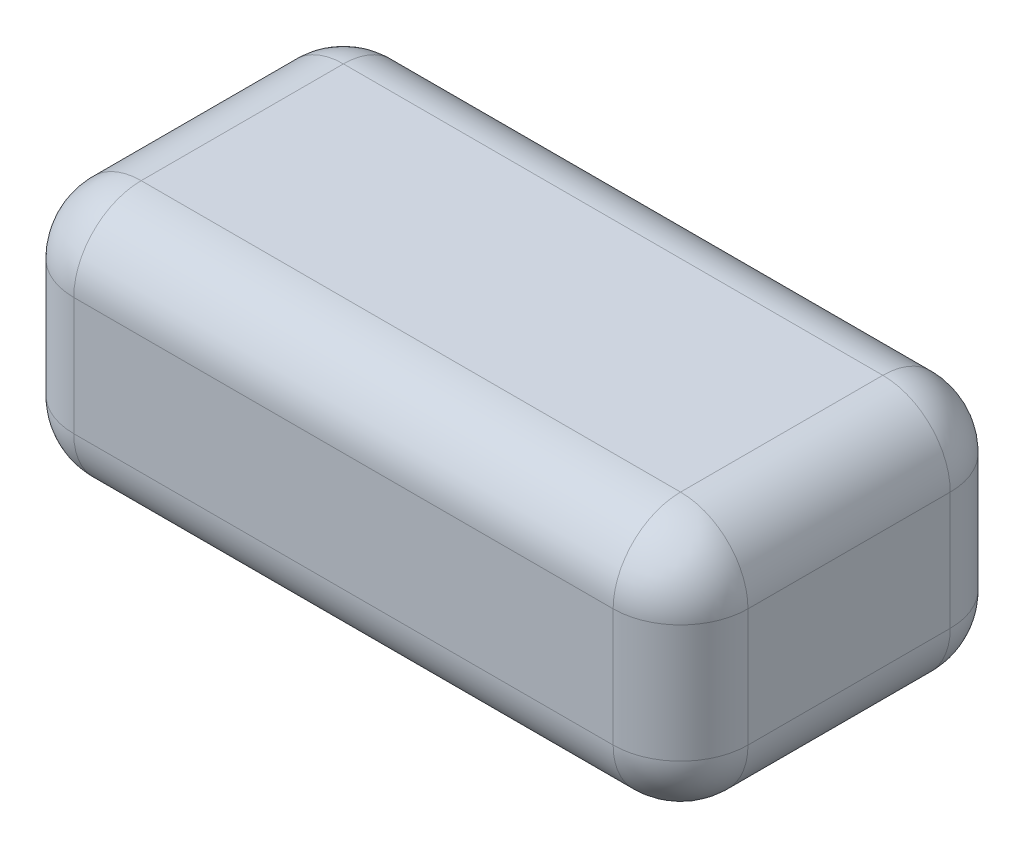
ISO-10303-21;
HEADER;
FILE_DESCRIPTION(('STEP AP214'),'2;1');
FILE_NAME('part.step','',(''),(''),'','','');
FILE_SCHEMA(('AUTOMOTIVE_DESIGN { 1 0 10303 214 1 1 1 1 }'));
ENDSEC;
DATA;
#1=APPLICATION_CONTEXT('core data for automotive mechanical design processes');
#2=APPLICATION_PROTOCOL_DEFINITION('international standard','automotive_design',2000,#1);
#3=PRODUCT_CONTEXT('',#1,'mechanical');
#4=PRODUCT('Part','Part','',(#3));
#5=PRODUCT_RELATED_PRODUCT_CATEGORY('part','',(#4));
#6=PRODUCT_DEFINITION_FORMATION('','',#4);
#7=PRODUCT_DEFINITION_CONTEXT('part definition',#1,'design');
#8=PRODUCT_DEFINITION('design','',#6,#7);
#9=PRODUCT_DEFINITION_SHAPE('','',#8);
#10=(LENGTH_UNIT() NAMED_UNIT(*) SI_UNIT(.MILLI.,.METRE.));
#11=(NAMED_UNIT(*) PLANE_ANGLE_UNIT() SI_UNIT($,.RADIAN.));
#12=(NAMED_UNIT(*) SI_UNIT($,.STERADIAN.) SOLID_ANGLE_UNIT());
#13=UNCERTAINTY_MEASURE_WITH_UNIT(LENGTH_MEASURE(1.E-05),#10,'distance_accuracy_value','');
#14=(GEOMETRIC_REPRESENTATION_CONTEXT(3) GLOBAL_UNCERTAINTY_ASSIGNED_CONTEXT((#13)) GLOBAL_UNIT_ASSIGNED_CONTEXT((#10,
#11,#12)) REPRESENTATION_CONTEXT('',''));
#15=CARTESIAN_POINT('',(0.,0.,0.));
#16=DIRECTION('',(0.,0.,1.));
#17=DIRECTION('',(1.,0.,0.));
#18=AXIS2_PLACEMENT_3D('',#15,#16,#17);
#19=CARTESIAN_POINT('',(100.,75.,50.));
#20=DIRECTION('',(-1.,0.,0.));
#21=DIRECTION('',(0.,0.,1.));
#22=AXIS2_PLACEMENT_3D('',#19,#20,#21);
#23=PLANE('',#22);
#24=DIRECTION('',(0.,0.,-1.));
#25=VECTOR('',#24,1.);
#26=CARTESIAN_POINT('',(100.,20.,-50.));
#27=LINE('',#26,#25);
#28=CARTESIAN_POINT('',(100.,20.,30.));
#29=VERTEX_POINT('',#28);
#30=CARTESIAN_POINT('',(100.,20.,-30.));
#31=VERTEX_POINT('',#30);
#32=EDGE_CURVE('E223',#29,#31,#27,.T.);
#33=ORIENTED_EDGE('',*,*,#32,.T.);
#34=DIRECTION('',(0.,-1.,0.));
#35=VECTOR('',#34,1.);
#36=CARTESIAN_POINT('',(100.,75.,-30.));
#37=LINE('',#36,#35);
#38=CARTESIAN_POINT('',(100.,55.,-30.));
#39=VERTEX_POINT('',#38);
#40=EDGE_CURVE('E226',#31,#39,#37,.F.);
#41=ORIENTED_EDGE('',*,*,#40,.T.);
#42=DIRECTION('',(0.,0.,-1.));
#43=VECTOR('',#42,1.);
#44=CARTESIAN_POINT('',(100.,55.,50.));
#45=LINE('',#44,#43);
#46=CARTESIAN_POINT('',(100.,55.,30.));
#47=VERTEX_POINT('',#46);
#48=EDGE_CURVE('E220',#39,#47,#45,.F.);
#49=ORIENTED_EDGE('',*,*,#48,.T.);
#50=DIRECTION('',(0.,-1.,0.));
#51=VECTOR('',#50,1.);
#52=CARTESIAN_POINT('',(100.,75.,30.));
#53=LINE('',#52,#51);
#54=EDGE_CURVE('E217',#47,#29,#53,.T.);
#55=ORIENTED_EDGE('',*,*,#54,.T.);
#56=EDGE_LOOP('',(#33,#41,#49,#55));
#57=FACE_BOUND('',#56,.T.);
#58=ADVANCED_FACE('F43',(#57),#23,.F.);
#59=CARTESIAN_POINT('',(-100.,75.,-50.));
#60=DIRECTION('',(0.,0.,1.));
#61=DIRECTION('',(1.,0.,0.));
#62=AXIS2_PLACEMENT_3D('',#59,#60,#61);
#63=PLANE('',#62);
#64=DIRECTION('',(-1.,0.,0.));
#65=VECTOR('',#64,1.);
#66=CARTESIAN_POINT('',(-100.,20.,-50.));
#67=LINE('',#66,#65);
#68=CARTESIAN_POINT('',(80.,20.,-50.));
#69=VERTEX_POINT('',#68);
#70=CARTESIAN_POINT('',(-80.,20.,-50.));
#71=VERTEX_POINT('',#70);
#72=EDGE_CURVE('E197',#69,#71,#67,.T.);
#73=ORIENTED_EDGE('',*,*,#72,.T.);
#74=DIRECTION('',(0.,-1.,0.));
#75=VECTOR('',#74,1.);
#76=CARTESIAN_POINT('',(-80.,75.,-50.));
#77=LINE('',#76,#75);
#78=CARTESIAN_POINT('',(-80.,55.,-50.));
#79=VERTEX_POINT('',#78);
#80=EDGE_CURVE('E200',#71,#79,#77,.F.);
#81=ORIENTED_EDGE('',*,*,#80,.T.);
#82=DIRECTION('',(-1.,0.,0.));
#83=VECTOR('',#82,1.);
#84=CARTESIAN_POINT('',(-100.,55.,-50.));
#85=LINE('',#84,#83);
#86=CARTESIAN_POINT('',(80.,55.,-50.));
#87=VERTEX_POINT('',#86);
#88=EDGE_CURVE('E194',#79,#87,#85,.F.);
#89=ORIENTED_EDGE('',*,*,#88,.T.);
#90=DIRECTION('',(0.,-1.,0.));
#91=VECTOR('',#90,1.);
#92=CARTESIAN_POINT('',(80.,75.,-50.));
#93=LINE('',#92,#91);
#94=EDGE_CURVE('E191',#87,#69,#93,.T.);
#95=ORIENTED_EDGE('',*,*,#94,.T.);
#96=EDGE_LOOP('',(#73,#81,#89,#95));
#97=FACE_BOUND('',#96,.T.);
#98=ADVANCED_FACE('F344',(#97),#63,.F.);
#99=CARTESIAN_POINT('',(-100.,75.,50.));
#100=DIRECTION('',(1.,0.,0.));
#101=DIRECTION('',(0.,0.,-1.));
#102=AXIS2_PLACEMENT_3D('',#99,#100,#101);
#103=PLANE('',#102);
#104=DIRECTION('',(0.,-1.,0.));
#105=VECTOR('',#104,1.);
#106=CARTESIAN_POINT('',(-100.,75.,-30.));
#107=LINE('',#106,#105);
#108=CARTESIAN_POINT('',(-100.,55.,-30.));
#109=VERTEX_POINT('',#108);
#110=CARTESIAN_POINT('',(-100.,20.,-30.));
#111=VERTEX_POINT('',#110);
#112=EDGE_CURVE('E172',#109,#111,#107,.T.);
#113=ORIENTED_EDGE('',*,*,#112,.T.);
#114=DIRECTION('',(0.,0.,1.));
#115=VECTOR('',#114,1.);
#116=CARTESIAN_POINT('',(-100.,20.,50.));
#117=LINE('',#116,#115);
#118=CARTESIAN_POINT('',(-100.,20.,30.));
#119=VERTEX_POINT('',#118);
#120=EDGE_CURVE('E141',#111,#119,#117,.T.);
#121=ORIENTED_EDGE('',*,*,#120,.T.);
#122=DIRECTION('',(0.,-1.,0.));
#123=VECTOR('',#122,1.);
#124=CARTESIAN_POINT('',(-100.,75.,30.));
#125=LINE('',#124,#123);
#126=CARTESIAN_POINT('',(-100.,55.,30.));
#127=VERTEX_POINT('',#126);
#128=EDGE_CURVE('E161',#119,#127,#125,.F.);
#129=ORIENTED_EDGE('',*,*,#128,.T.);
#130=DIRECTION('',(0.,0.,1.));
#131=VECTOR('',#130,1.);
#132=CARTESIAN_POINT('',(-100.,55.,50.));
#133=LINE('',#132,#131);
#134=EDGE_CURVE('E168',#127,#109,#133,.F.);
#135=ORIENTED_EDGE('',*,*,#134,.T.);
#136=EDGE_LOOP('',(#113,#121,#129,#135));
#137=FACE_BOUND('',#136,.T.);
#138=ADVANCED_FACE('F170',(#137),#103,.F.);
#139=CARTESIAN_POINT('',(-100.,75.,50.));
#140=DIRECTION('',(0.,0.,-1.));
#141=DIRECTION('',(-1.,0.,0.));
#142=AXIS2_PLACEMENT_3D('',#139,#140,#141);
#143=PLANE('',#142);
#144=DIRECTION('',(0.,-1.,0.));
#145=VECTOR('',#144,1.);
#146=CARTESIAN_POINT('',(-80.,75.,50.));
#147=LINE('',#146,#145);
#148=CARTESIAN_POINT('',(-80.,55.,50.));
#149=VERTEX_POINT('',#148);
#150=CARTESIAN_POINT('',(-80.,20.,50.));
#151=VERTEX_POINT('',#150);
#152=EDGE_CURVE('E230',#149,#151,#147,.T.);
#153=ORIENTED_EDGE('',*,*,#152,.T.);
#154=DIRECTION('',(1.,0.,0.));
#155=VECTOR('',#154,1.);
#156=CARTESIAN_POINT('',(100.,20.,50.));
#157=LINE('',#156,#155);
#158=CARTESIAN_POINT('',(80.,20.,50.));
#159=VERTEX_POINT('',#158);
#160=EDGE_CURVE('E11',#151,#159,#157,.T.);
#161=ORIENTED_EDGE('',*,*,#160,.T.);
#162=DIRECTION('',(0.,-1.,0.));
#163=VECTOR('',#162,1.);
#164=CARTESIAN_POINT('',(80.,75.,50.));
#165=LINE('',#164,#163);
#166=CARTESIAN_POINT('',(80.,55.,50.));
#167=VERTEX_POINT('',#166);
#168=EDGE_CURVE('E53',#159,#167,#165,.F.);
#169=ORIENTED_EDGE('',*,*,#168,.T.);
#170=DIRECTION('',(1.,0.,0.));
#171=VECTOR('',#170,1.);
#172=CARTESIAN_POINT('',(-100.,55.,50.));
#173=LINE('',#172,#171);
#174=EDGE_CURVE('E233',#167,#149,#173,.F.);
#175=ORIENTED_EDGE('',*,*,#174,.T.);
#176=EDGE_LOOP('',(#153,#161,#169,#175));
#177=FACE_BOUND('',#176,.T.);
#178=ADVANCED_FACE('F369',(#177),#143,.F.);
#179=CARTESIAN_POINT('',(0.,75.,0.));
#180=DIRECTION('',(0.,-1.,0.));
#181=DIRECTION('',(0.,0.,-1.));
#182=AXIS2_PLACEMENT_3D('',#179,#180,#181);
#183=PLANE('',#182);
#184=DIRECTION('',(0.,0.,-1.));
#185=VECTOR('',#184,1.);
#186=CARTESIAN_POINT('',(80.,75.,0.));
#187=LINE('',#186,#185);
#188=CARTESIAN_POINT('',(80.,75.,30.));
#189=VERTEX_POINT('',#188);
#190=CARTESIAN_POINT('',(80.,75.,-30.));
#191=VERTEX_POINT('',#190);
#192=EDGE_CURVE('E210',#189,#191,#187,.T.);
#193=ORIENTED_EDGE('',*,*,#192,.T.);
#194=DIRECTION('',(-1.,0.,0.));
#195=VECTOR('',#194,1.);
#196=CARTESIAN_POINT('',(0.,75.,-30.));
#197=LINE('',#196,#195);
#198=CARTESIAN_POINT('',(-80.,75.,-30.));
#199=VERTEX_POINT('',#198);
#200=EDGE_CURVE('E213',#191,#199,#197,.T.);
#201=ORIENTED_EDGE('',*,*,#200,.T.);
#202=DIRECTION('',(0.,0.,1.));
#203=VECTOR('',#202,1.);
#204=CARTESIAN_POINT('',(-80.,75.,0.));
#205=LINE('',#204,#203);
#206=CARTESIAN_POINT('',(-80.,75.,30.));
#207=VERTEX_POINT('',#206);
#208=EDGE_CURVE('E204',#199,#207,#205,.T.);
#209=ORIENTED_EDGE('',*,*,#208,.T.);
#210=DIRECTION('',(1.,0.,0.));
#211=VECTOR('',#210,1.);
#212=CARTESIAN_POINT('',(0.,75.,30.));
#213=LINE('',#212,#211);
#214=EDGE_CURVE('E207',#207,#189,#213,.T.);
#215=ORIENTED_EDGE('',*,*,#214,.T.);
#216=EDGE_LOOP('',(#193,#201,#209,#215));
#217=FACE_BOUND('',#216,.T.);
#218=ADVANCED_FACE('F358',(#217),#183,.F.);
#219=CARTESIAN_POINT('',(0.,0.,0.));
#220=DIRECTION('',(0.,-1.,0.));
#221=DIRECTION('',(0.,0.,-1.));
#222=AXIS2_PLACEMENT_3D('',#219,#220,#221);
#223=PLANE('',#222);
#224=DIRECTION('',(1.,0.,0.));
#225=VECTOR('',#224,1.);
#226=CARTESIAN_POINT('',(-100.,0.,30.));
#227=LINE('',#226,#225);
#228=CARTESIAN_POINT('',(80.,0.,30.));
#229=VERTEX_POINT('',#228);
#230=CARTESIAN_POINT('',(-80.,0.,30.));
#231=VERTEX_POINT('',#230);
#232=EDGE_CURVE('E175',#229,#231,#227,.F.);
#233=ORIENTED_EDGE('',*,*,#232,.T.);
#234=DIRECTION('',(0.,0.,1.));
#235=VECTOR('',#234,1.);
#236=CARTESIAN_POINT('',(-80.,0.,-50.));
#237=LINE('',#236,#235);
#238=CARTESIAN_POINT('',(-80.,0.,-30.));
#239=VERTEX_POINT('',#238);
#240=EDGE_CURVE('E143',#231,#239,#237,.F.);
#241=ORIENTED_EDGE('',*,*,#240,.T.);
#242=DIRECTION('',(-1.,0.,0.));
#243=VECTOR('',#242,1.);
#244=CARTESIAN_POINT('',(100.,0.,-30.));
#245=LINE('',#244,#243);
#246=CARTESIAN_POINT('',(80.,0.,-30.));
#247=VERTEX_POINT('',#246);
#248=EDGE_CURVE('E186',#239,#247,#245,.F.);
#249=ORIENTED_EDGE('',*,*,#248,.T.);
#250=DIRECTION('',(0.,0.,-1.));
#251=VECTOR('',#250,1.);
#252=CARTESIAN_POINT('',(80.,0.,50.));
#253=LINE('',#252,#251);
#254=EDGE_CURVE('E179',#247,#229,#253,.F.);
#255=ORIENTED_EDGE('',*,*,#254,.T.);
#256=EDGE_LOOP('',(#233,#241,#249,#255));
#257=FACE_BOUND('',#256,.T.);
#258=ADVANCED_FACE('F372',(#257),#223,.T.);
#259=CARTESIAN_POINT('',(80.,55.,0.));
#260=DIRECTION('',(0.,0.,-1.));
#261=DIRECTION('',(-1.,0.,0.));
#262=AXIS2_PLACEMENT_3D('',#259,#260,#261);
#263=CYLINDRICAL_SURFACE('',#262,20.);
#264=CARTESIAN_POINT('',(80.,55.,-30.));
#265=DIRECTION('',(0.,0.,-1.));
#266=DIRECTION('',(-1.,0.,0.));
#267=AXIS2_PLACEMENT_3D('',#264,#265,#266);
#268=CIRCLE('',#267,20.);
#269=EDGE_CURVE('E47',#191,#39,#268,.T.);
#270=ORIENTED_EDGE('',*,*,#269,.F.);
#271=ORIENTED_EDGE('',*,*,#192,.F.);
#272=CARTESIAN_POINT('',(80.,55.,30.));
#273=DIRECTION('',(0.,0.,1.));
#274=DIRECTION('',(1.,0.,0.));
#275=AXIS2_PLACEMENT_3D('',#272,#273,#274);
#276=CIRCLE('',#275,20.);
#277=EDGE_CURVE('E303',#47,#189,#276,.T.);
#278=ORIENTED_EDGE('',*,*,#277,.F.);
#279=ORIENTED_EDGE('',*,*,#48,.F.);
#280=EDGE_LOOP('',(#270,#271,#278,#279));
#281=FACE_BOUND('',#280,.T.);
#282=ADVANCED_FACE('F45',(#281),#263,.T.);
#283=CARTESIAN_POINT('',(80.,55.,-30.));
#284=DIRECTION('',(1.,0.,0.));
#285=DIRECTION('',(0.,0.,-1.));
#286=AXIS2_PLACEMENT_3D('',#283,#284,#285);
#287=SPHERICAL_SURFACE('',#286,20.);
#288=CARTESIAN_POINT('',(80.,55.,-30.));
#289=DIRECTION('',(1.,0.,0.));
#290=DIRECTION('',(0.,1.,0.));
#291=AXIS2_PLACEMENT_3D('',#288,#289,#290);
#292=CIRCLE('',#291,20.);
#293=EDGE_CURVE('E297',#191,#87,#292,.F.);
#294=ORIENTED_EDGE('',*,*,#293,.F.);
#295=ORIENTED_EDGE('',*,*,#269,.T.);
#296=CARTESIAN_POINT('',(80.,55.,-30.));
#297=DIRECTION('',(0.,1.,0.));
#298=DIRECTION('',(0.,0.,1.));
#299=AXIS2_PLACEMENT_3D('',#296,#297,#298);
#300=CIRCLE('',#299,20.);
#301=EDGE_CURVE('E301',#87,#39,#300,.F.);
#302=ORIENTED_EDGE('',*,*,#301,.F.);
#303=EDGE_LOOP('',(#294,#295,#302));
#304=FACE_BOUND('',#303,.T.);
#305=ADVANCED_FACE('F317',(#304),#287,.T.);
#306=CARTESIAN_POINT('',(80.,55.,30.));
#307=DIRECTION('',(0.,1.,0.));
#308=DIRECTION('',(0.,0.,1.));
#309=AXIS2_PLACEMENT_3D('',#306,#307,#308);
#310=SPHERICAL_SURFACE('',#309,20.);
#311=CARTESIAN_POINT('',(80.,55.,30.));
#312=DIRECTION('',(0.,1.,0.));
#313=DIRECTION('',(0.,0.,1.));
#314=AXIS2_PLACEMENT_3D('',#311,#312,#313);
#315=CIRCLE('',#314,20.);
#316=EDGE_CURVE('E290',#47,#167,#315,.F.);
#317=ORIENTED_EDGE('',*,*,#316,.F.);
#318=ORIENTED_EDGE('',*,*,#277,.T.);
#319=CARTESIAN_POINT('',(80.,55.,30.));
#320=DIRECTION('',(1.,0.,0.));
#321=DIRECTION('',(0.,0.,-1.));
#322=AXIS2_PLACEMENT_3D('',#319,#320,#321);
#323=CIRCLE('',#322,20.);
#324=EDGE_CURVE('E293',#167,#189,#323,.F.);
#325=ORIENTED_EDGE('',*,*,#324,.F.);
#326=EDGE_LOOP('',(#317,#318,#325));
#327=FACE_BOUND('',#326,.T.);
#328=ADVANCED_FACE('F378',(#327),#310,.T.);
#329=CARTESIAN_POINT('',(80.,75.,-30.));
#330=DIRECTION('',(0.,-1.,0.));
#331=DIRECTION('',(0.,0.,-1.));
#332=AXIS2_PLACEMENT_3D('',#329,#330,#331);
#333=CYLINDRICAL_SURFACE('',#332,20.);
#334=ORIENTED_EDGE('',*,*,#301,.T.);
#335=ORIENTED_EDGE('',*,*,#40,.F.);
#336=CARTESIAN_POINT('',(80.,20.,-30.));
#337=DIRECTION('',(0.,-1.,0.));
#338=DIRECTION('',(0.,0.,-1.));
#339=AXIS2_PLACEMENT_3D('',#336,#337,#338);
#340=CIRCLE('',#339,20.);
#341=EDGE_CURVE('E282',#69,#31,#340,.T.);
#342=ORIENTED_EDGE('',*,*,#341,.F.);
#343=ORIENTED_EDGE('',*,*,#94,.F.);
#344=EDGE_LOOP('',(#334,#335,#342,#343));
#345=FACE_BOUND('',#344,.T.);
#346=ADVANCED_FACE('F328',(#345),#333,.T.);
#347=CARTESIAN_POINT('',(0.,55.,-30.));
#348=DIRECTION('',(-1.,0.,0.));
#349=DIRECTION('',(0.,0.,1.));
#350=AXIS2_PLACEMENT_3D('',#347,#348,#349);
#351=CYLINDRICAL_SURFACE('',#350,20.);
#352=ORIENTED_EDGE('',*,*,#293,.T.);
#353=ORIENTED_EDGE('',*,*,#88,.F.);
#354=CARTESIAN_POINT('',(-80.,55.,-30.));
#355=DIRECTION('',(-1.,0.,0.));
#356=DIRECTION('',(0.,0.,1.));
#357=AXIS2_PLACEMENT_3D('',#354,#355,#356);
#358=CIRCLE('',#357,20.);
#359=EDGE_CURVE('E278',#199,#79,#358,.T.);
#360=ORIENTED_EDGE('',*,*,#359,.F.);
#361=ORIENTED_EDGE('',*,*,#200,.F.);
#362=EDGE_LOOP('',(#352,#353,#360,#361));
#363=FACE_BOUND('',#362,.T.);
#364=ADVANCED_FACE('F356',(#363),#351,.T.);
#365=CARTESIAN_POINT('',(-80.,55.,0.));
#366=DIRECTION('',(0.,0.,1.));
#367=DIRECTION('',(1.,0.,0.));
#368=AXIS2_PLACEMENT_3D('',#365,#366,#367);
#369=CYLINDRICAL_SURFACE('',#368,20.);
#370=CARTESIAN_POINT('',(-80.,55.,30.));
#371=DIRECTION('',(0.,0.,1.));
#372=DIRECTION('',(1.,0.,0.));
#373=AXIS2_PLACEMENT_3D('',#370,#371,#372);
#374=CIRCLE('',#373,20.);
#375=EDGE_CURVE('E271',#207,#127,#374,.T.);
#376=ORIENTED_EDGE('',*,*,#375,.F.);
#377=ORIENTED_EDGE('',*,*,#208,.F.);
#378=CARTESIAN_POINT('',(-80.,55.,-30.));
#379=DIRECTION('',(0.,0.,-1.));
#380=DIRECTION('',(0.,1.,0.));
#381=AXIS2_PLACEMENT_3D('',#378,#379,#380);
#382=CIRCLE('',#381,20.);
#383=EDGE_CURVE('E275',#109,#199,#382,.T.);
#384=ORIENTED_EDGE('',*,*,#383,.F.);
#385=ORIENTED_EDGE('',*,*,#134,.F.);
#386=EDGE_LOOP('',(#376,#377,#384,#385));
#387=FACE_BOUND('',#386,.T.);
#388=ADVANCED_FACE('F366',(#387),#369,.T.);
#389=CARTESIAN_POINT('',(0.,55.,30.));
#390=DIRECTION('',(1.,0.,0.));
#391=DIRECTION('',(0.,0.,-1.));
#392=AXIS2_PLACEMENT_3D('',#389,#390,#391);
#393=CYLINDRICAL_SURFACE('',#392,20.);
#394=ORIENTED_EDGE('',*,*,#324,.T.);
#395=ORIENTED_EDGE('',*,*,#214,.F.);
#396=CARTESIAN_POINT('',(-80.,55.,30.));
#397=DIRECTION('',(-1.,0.,0.));
#398=DIRECTION('',(0.,0.,1.));
#399=AXIS2_PLACEMENT_3D('',#396,#397,#398);
#400=CIRCLE('',#399,20.);
#401=EDGE_CURVE('E267',#149,#207,#400,.T.);
#402=ORIENTED_EDGE('',*,*,#401,.F.);
#403=ORIENTED_EDGE('',*,*,#174,.F.);
#404=EDGE_LOOP('',(#394,#395,#402,#403));
#405=FACE_BOUND('',#404,.T.);
#406=ADVANCED_FACE('F363',(#405),#393,.T.);
#407=CARTESIAN_POINT('',(80.,75.,30.));
#408=DIRECTION('',(0.,-1.,0.));
#409=DIRECTION('',(0.,0.,-1.));
#410=AXIS2_PLACEMENT_3D('',#407,#408,#409);
#411=CYLINDRICAL_SURFACE('',#410,20.);
#412=ORIENTED_EDGE('',*,*,#316,.T.);
#413=ORIENTED_EDGE('',*,*,#168,.F.);
#414=CARTESIAN_POINT('',(80.,20.,30.));
#415=DIRECTION('',(0.,-1.,0.));
#416=DIRECTION('',(0.,0.,-1.));
#417=AXIS2_PLACEMENT_3D('',#414,#415,#416);
#418=CIRCLE('',#417,20.);
#419=EDGE_CURVE('E264',#29,#159,#418,.T.);
#420=ORIENTED_EDGE('',*,*,#419,.F.);
#421=ORIENTED_EDGE('',*,*,#54,.F.);
#422=EDGE_LOOP('',(#412,#413,#420,#421));
#423=FACE_BOUND('',#422,.T.);
#424=ADVANCED_FACE('F377',(#423),#411,.T.);
#425=CARTESIAN_POINT('',(80.,20.,50.));
#426=DIRECTION('',(0.,0.,1.));
#427=DIRECTION('',(1.,0.,0.));
#428=AXIS2_PLACEMENT_3D('',#425,#426,#427);
#429=CYLINDRICAL_SURFACE('',#428,20.);
#430=CARTESIAN_POINT('',(80.,20.,-30.));
#431=DIRECTION('',(0.,0.,-1.));
#432=DIRECTION('',(-1.,0.,0.));
#433=AXIS2_PLACEMENT_3D('',#430,#431,#432);
#434=CIRCLE('',#433,20.);
#435=EDGE_CURVE('E286',#31,#247,#434,.T.);
#436=ORIENTED_EDGE('',*,*,#435,.F.);
#437=ORIENTED_EDGE('',*,*,#32,.F.);
#438=CARTESIAN_POINT('',(80.,20.,30.));
#439=DIRECTION('',(0.,0.,1.));
#440=DIRECTION('',(1.,0.,0.));
#441=AXIS2_PLACEMENT_3D('',#438,#439,#440);
#442=CIRCLE('',#441,20.);
#443=EDGE_CURVE('E260',#229,#29,#442,.T.);
#444=ORIENTED_EDGE('',*,*,#443,.F.);
#445=ORIENTED_EDGE('',*,*,#254,.F.);
#446=EDGE_LOOP('',(#436,#437,#444,#445));
#447=FACE_BOUND('',#446,.T.);
#448=ADVANCED_FACE('F332',(#447),#429,.T.);
#449=CARTESIAN_POINT('',(80.,20.,-30.));
#450=DIRECTION('',(1.,0.,0.));
#451=DIRECTION('',(0.,1.,0.));
#452=AXIS2_PLACEMENT_3D('',#449,#450,#451);
#453=SPHERICAL_SURFACE('',#452,20.);
#454=ORIENTED_EDGE('',*,*,#341,.T.);
#455=ORIENTED_EDGE('',*,*,#435,.T.);
#456=CARTESIAN_POINT('',(80.,20.,-30.));
#457=DIRECTION('',(1.,0.,0.));
#458=DIRECTION('',(0.,0.,-1.));
#459=AXIS2_PLACEMENT_3D('',#456,#457,#458);
#460=CIRCLE('',#459,20.);
#461=EDGE_CURVE('E256',#69,#247,#460,.F.);
#462=ORIENTED_EDGE('',*,*,#461,.F.);
#463=EDGE_LOOP('',(#454,#455,#462));
#464=FACE_BOUND('',#463,.T.);
#465=ADVANCED_FACE('F336',(#464),#453,.T.);
#466=CARTESIAN_POINT('',(-80.,55.,-30.));
#467=DIRECTION('',(0.,1.,0.));
#468=DIRECTION('',(0.,0.,1.));
#469=AXIS2_PLACEMENT_3D('',#466,#467,#468);
#470=SPHERICAL_SURFACE('',#469,20.);
#471=ORIENTED_EDGE('',*,*,#383,.T.);
#472=ORIENTED_EDGE('',*,*,#359,.T.);
#473=CARTESIAN_POINT('',(-80.,55.,-30.));
#474=DIRECTION('',(0.,1.,0.));
#475=DIRECTION('',(0.,0.,1.));
#476=AXIS2_PLACEMENT_3D('',#473,#474,#475);
#477=CIRCLE('',#476,20.);
#478=EDGE_CURVE('E253',#109,#79,#477,.F.);
#479=ORIENTED_EDGE('',*,*,#478,.F.);
#480=EDGE_LOOP('',(#471,#472,#479));
#481=FACE_BOUND('',#480,.T.);
#482=ADVANCED_FACE('F352',(#481),#470,.T.);
#483=CARTESIAN_POINT('',(-80.,55.,30.));
#484=DIRECTION('',(0.,1.,0.));
#485=DIRECTION('',(0.,0.,1.));
#486=AXIS2_PLACEMENT_3D('',#483,#484,#485);
#487=SPHERICAL_SURFACE('',#486,20.);
#488=ORIENTED_EDGE('',*,*,#401,.T.);
#489=ORIENTED_EDGE('',*,*,#375,.T.);
#490=CARTESIAN_POINT('',(-80.,55.,30.));
#491=DIRECTION('',(0.,1.,0.));
#492=DIRECTION('',(0.,0.,1.));
#493=AXIS2_PLACEMENT_3D('',#490,#491,#492);
#494=CIRCLE('',#493,20.);
#495=EDGE_CURVE('E164',#149,#127,#494,.F.);
#496=ORIENTED_EDGE('',*,*,#495,.F.);
#497=EDGE_LOOP('',(#488,#489,#496));
#498=FACE_BOUND('',#497,.T.);
#499=ADVANCED_FACE('F368',(#498),#487,.T.);
#500=CARTESIAN_POINT('',(80.,20.,30.));
#501=DIRECTION('',(1.,0.,0.));
#502=DIRECTION('',(0.,1.,0.));
#503=AXIS2_PLACEMENT_3D('',#500,#501,#502);
#504=SPHERICAL_SURFACE('',#503,20.);
#505=ORIENTED_EDGE('',*,*,#443,.T.);
#506=ORIENTED_EDGE('',*,*,#419,.T.);
#507=CARTESIAN_POINT('',(80.,20.,30.));
#508=DIRECTION('',(1.,0.,0.));
#509=DIRECTION('',(0.,0.,-1.));
#510=AXIS2_PLACEMENT_3D('',#507,#508,#509);
#511=CIRCLE('',#510,20.);
#512=EDGE_CURVE('E61',#229,#159,#511,.F.);
#513=ORIENTED_EDGE('',*,*,#512,.F.);
#514=EDGE_LOOP('',(#505,#506,#513));
#515=FACE_BOUND('',#514,.T.);
#516=ADVANCED_FACE('F374',(#515),#504,.T.);
#517=CARTESIAN_POINT('',(-100.,20.,-30.));
#518=DIRECTION('',(1.,0.,0.));
#519=DIRECTION('',(0.,0.,-1.));
#520=AXIS2_PLACEMENT_3D('',#517,#518,#519);
#521=CYLINDRICAL_SURFACE('',#520,20.);
#522=ORIENTED_EDGE('',*,*,#461,.T.);
#523=ORIENTED_EDGE('',*,*,#248,.F.);
#524=CARTESIAN_POINT('',(-80.,20.,-30.));
#525=DIRECTION('',(-1.,0.,0.));
#526=DIRECTION('',(0.,0.,1.));
#527=AXIS2_PLACEMENT_3D('',#524,#525,#526);
#528=CIRCLE('',#527,20.);
#529=EDGE_CURVE('E245',#71,#239,#528,.T.);
#530=ORIENTED_EDGE('',*,*,#529,.F.);
#531=ORIENTED_EDGE('',*,*,#72,.F.);
#532=EDGE_LOOP('',(#522,#523,#530,#531));
#533=FACE_BOUND('',#532,.T.);
#534=ADVANCED_FACE('F341',(#533),#521,.T.);
#535=CARTESIAN_POINT('',(-80.,75.,-30.));
#536=DIRECTION('',(0.,-1.,0.));
#537=DIRECTION('',(0.,0.,-1.));
#538=AXIS2_PLACEMENT_3D('',#535,#536,#537);
#539=CYLINDRICAL_SURFACE('',#538,20.);
#540=ORIENTED_EDGE('',*,*,#478,.T.);
#541=ORIENTED_EDGE('',*,*,#80,.F.);
#542=CARTESIAN_POINT('',(-80.,20.,-30.));
#543=DIRECTION('',(0.,-1.,0.));
#544=DIRECTION('',(0.,0.,-1.));
#545=AXIS2_PLACEMENT_3D('',#542,#543,#544);
#546=CIRCLE('',#545,20.);
#547=EDGE_CURVE('E158',#111,#71,#546,.T.);
#548=ORIENTED_EDGE('',*,*,#547,.F.);
#549=ORIENTED_EDGE('',*,*,#112,.F.);
#550=EDGE_LOOP('',(#540,#541,#548,#549));
#551=FACE_BOUND('',#550,.T.);
#552=ADVANCED_FACE('F346',(#551),#539,.T.);
#553=CARTESIAN_POINT('',(-80.,75.,30.));
#554=DIRECTION('',(0.,-1.,0.));
#555=DIRECTION('',(0.,0.,-1.));
#556=AXIS2_PLACEMENT_3D('',#553,#554,#555);
#557=CYLINDRICAL_SURFACE('',#556,20.);
#558=ORIENTED_EDGE('',*,*,#495,.T.);
#559=ORIENTED_EDGE('',*,*,#128,.F.);
#560=CARTESIAN_POINT('',(-80.,20.,30.));
#561=DIRECTION('',(0.,-1.,0.));
#562=DIRECTION('',(0.,0.,-1.));
#563=AXIS2_PLACEMENT_3D('',#560,#561,#562);
#564=CIRCLE('',#563,20.);
#565=EDGE_CURVE('E150',#151,#119,#564,.T.);
#566=ORIENTED_EDGE('',*,*,#565,.F.);
#567=ORIENTED_EDGE('',*,*,#152,.F.);
#568=EDGE_LOOP('',(#558,#559,#566,#567));
#569=FACE_BOUND('',#568,.T.);
#570=ADVANCED_FACE('F162',(#569),#557,.T.);
#571=CARTESIAN_POINT('',(-100.,20.,30.));
#572=DIRECTION('',(-1.,0.,0.));
#573=DIRECTION('',(0.,0.,1.));
#574=AXIS2_PLACEMENT_3D('',#571,#572,#573);
#575=CYLINDRICAL_SURFACE('',#574,20.);
#576=ORIENTED_EDGE('',*,*,#512,.T.);
#577=ORIENTED_EDGE('',*,*,#160,.F.);
#578=CARTESIAN_POINT('',(-80.,20.,30.));
#579=DIRECTION('',(-1.,0.,0.));
#580=DIRECTION('',(0.,0.,1.));
#581=AXIS2_PLACEMENT_3D('',#578,#579,#580);
#582=CIRCLE('',#581,20.);
#583=EDGE_CURVE('E154',#231,#151,#582,.T.);
#584=ORIENTED_EDGE('',*,*,#583,.F.);
#585=ORIENTED_EDGE('',*,*,#232,.F.);
#586=EDGE_LOOP('',(#576,#577,#584,#585));
#587=FACE_BOUND('',#586,.T.);
#588=ADVANCED_FACE('F370',(#587),#575,.T.);
#589=CARTESIAN_POINT('',(-80.,20.,-30.));
#590=DIRECTION('',(0.,0.,-1.));
#591=DIRECTION('',(0.,1.,0.));
#592=AXIS2_PLACEMENT_3D('',#589,#590,#591);
#593=SPHERICAL_SURFACE('',#592,20.);
#594=ORIENTED_EDGE('',*,*,#547,.T.);
#595=ORIENTED_EDGE('',*,*,#529,.T.);
#596=CARTESIAN_POINT('',(-80.,20.,-30.));
#597=DIRECTION('',(0.,0.,-1.));
#598=DIRECTION('',(-1.,0.,0.));
#599=AXIS2_PLACEMENT_3D('',#596,#597,#598);
#600=CIRCLE('',#599,20.);
#601=EDGE_CURVE('E147',#111,#239,#600,.F.);
#602=ORIENTED_EDGE('',*,*,#601,.F.);
#603=EDGE_LOOP('',(#594,#595,#602));
#604=FACE_BOUND('',#603,.T.);
#605=ADVANCED_FACE('F398',(#604),#593,.T.);
#606=CARTESIAN_POINT('',(-80.,20.,30.));
#607=DIRECTION('',(0.,0.,1.));
#608=DIRECTION('',(0.,-1.,0.));
#609=AXIS2_PLACEMENT_3D('',#606,#607,#608);
#610=SPHERICAL_SURFACE('',#609,20.);
#611=ORIENTED_EDGE('',*,*,#583,.T.);
#612=ORIENTED_EDGE('',*,*,#565,.T.);
#613=CARTESIAN_POINT('',(-80.,20.,30.));
#614=DIRECTION('',(0.,0.,1.));
#615=DIRECTION('',(1.,0.,0.));
#616=AXIS2_PLACEMENT_3D('',#613,#614,#615);
#617=CIRCLE('',#616,20.);
#618=EDGE_CURVE('E137',#231,#119,#617,.F.);
#619=ORIENTED_EDGE('',*,*,#618,.F.);
#620=EDGE_LOOP('',(#611,#612,#619));
#621=FACE_BOUND('',#620,.T.);
#622=ADVANCED_FACE('F152',(#621),#610,.T.);
#623=CARTESIAN_POINT('',(-80.,20.,50.));
#624=DIRECTION('',(0.,0.,-1.));
#625=DIRECTION('',(-1.,0.,0.));
#626=AXIS2_PLACEMENT_3D('',#623,#624,#625);
#627=CYLINDRICAL_SURFACE('',#626,20.);
#628=ORIENTED_EDGE('',*,*,#601,.T.);
#629=ORIENTED_EDGE('',*,*,#240,.F.);
#630=ORIENTED_EDGE('',*,*,#618,.T.);
#631=ORIENTED_EDGE('',*,*,#120,.F.);
#632=EDGE_LOOP('',(#628,#629,#630,#631));
#633=FACE_BOUND('',#632,.T.);
#634=ADVANCED_FACE('F139',(#633),#627,.T.);
#635=CLOSED_SHELL('',(#58,#98,#138,#178,#218,#258,#282,#305,#328,#346,#364,#388,#406,#424,#448,
#465,#482,#499,#516,#534,#552,#570,#588,#605,#622,#634));
#636=MANIFOLD_SOLID_BREP('B2',#635);
#637=ADVANCED_BREP_SHAPE_REPRESENTATION('',(#18,#636),#14);
#638=SHAPE_DEFINITION_REPRESENTATION(#9,#637);
ENDSEC;
END-ISO-10303-21;
